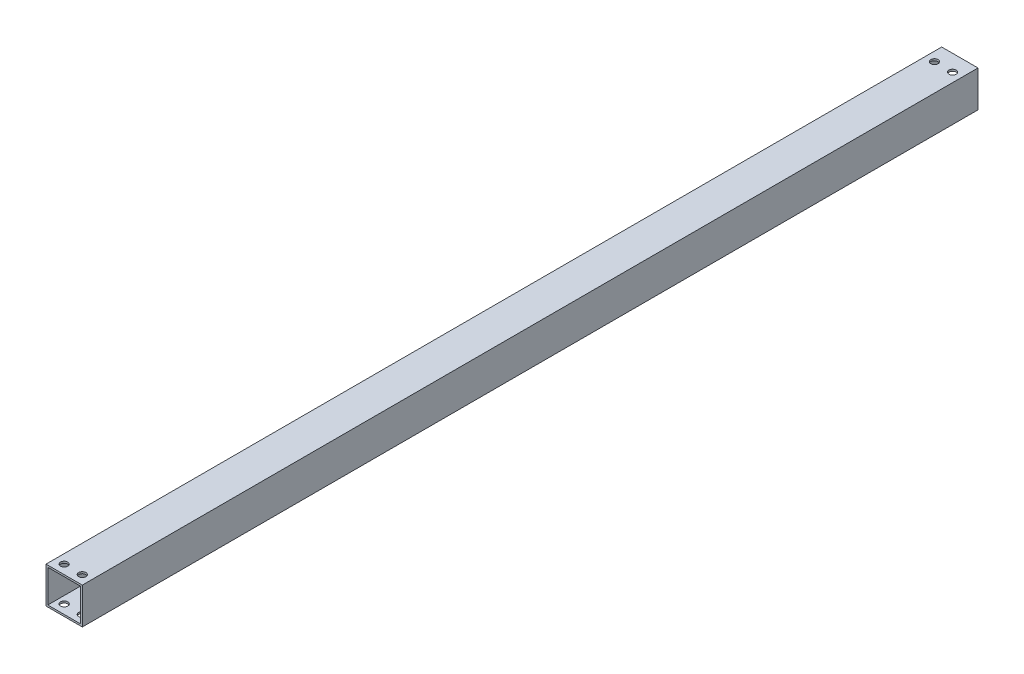
ISO-10303-21;
HEADER;
FILE_DESCRIPTION(('STEP AP214'),'2;1');
FILE_NAME('part.step','',(''),(''),'','','');
FILE_SCHEMA(('AUTOMOTIVE_DESIGN { 1 0 10303 214 1 1 1 1 }'));
ENDSEC;
DATA;
#1=APPLICATION_CONTEXT('core data for automotive mechanical design processes');
#2=APPLICATION_PROTOCOL_DEFINITION('international standard','automotive_design',2000,#1);
#3=PRODUCT_CONTEXT('',#1,'mechanical');
#4=PRODUCT('Part','Part','',(#3));
#5=PRODUCT_RELATED_PRODUCT_CATEGORY('part','',(#4));
#6=PRODUCT_DEFINITION_FORMATION('','',#4);
#7=PRODUCT_DEFINITION_CONTEXT('part definition',#1,'design');
#8=PRODUCT_DEFINITION('design','',#6,#7);
#9=PRODUCT_DEFINITION_SHAPE('','',#8);
#10=(LENGTH_UNIT() NAMED_UNIT(*) SI_UNIT(.MILLI.,.METRE.));
#11=(NAMED_UNIT(*) PLANE_ANGLE_UNIT() SI_UNIT($,.RADIAN.));
#12=(NAMED_UNIT(*) SI_UNIT($,.STERADIAN.) SOLID_ANGLE_UNIT());
#13=UNCERTAINTY_MEASURE_WITH_UNIT(LENGTH_MEASURE(1.E-05),#10,'distance_accuracy_value','');
#14=(GEOMETRIC_REPRESENTATION_CONTEXT(3) GLOBAL_UNCERTAINTY_ASSIGNED_CONTEXT((#13)) GLOBAL_UNIT_ASSIGNED_CONTEXT((#10,
#11,#12)) REPRESENTATION_CONTEXT('',''));
#15=CARTESIAN_POINT('',(0.,0.,0.));
#16=DIRECTION('',(0.,0.,1.));
#17=DIRECTION('',(1.,0.,0.));
#18=AXIS2_PLACEMENT_3D('',#15,#16,#17);
#19=CARTESIAN_POINT('',(0.,0.,493.33));
#20=DIRECTION('',(0.,0.,1.));
#21=DIRECTION('',(1.,0.,0.));
#22=AXIS2_PLACEMENT_3D('',#19,#20,#21);
#23=PLANE('',#22);
#24=DIRECTION('',(0.,1.,0.));
#25=VECTOR('',#24,1.);
#26=CARTESIAN_POINT('',(10.,10.,493.33));
#27=LINE('',#26,#25);
#28=CARTESIAN_POINT('',(10.,-10.,493.33));
#29=VERTEX_POINT('',#28);
#30=CARTESIAN_POINT('',(10.,10.,493.33));
#31=VERTEX_POINT('',#30);
#32=EDGE_CURVE('E161',#29,#31,#27,.T.);
#33=ORIENTED_EDGE('',*,*,#32,.T.);
#34=DIRECTION('',(-1.,0.,0.));
#35=VECTOR('',#34,1.);
#36=CARTESIAN_POINT('',(-10.,10.,493.33));
#37=LINE('',#36,#35);
#38=CARTESIAN_POINT('',(-10.,10.,493.33));
#39=VERTEX_POINT('',#38);
#40=EDGE_CURVE('E165',#31,#39,#37,.T.);
#41=ORIENTED_EDGE('',*,*,#40,.T.);
#42=DIRECTION('',(0.,-1.,0.));
#43=VECTOR('',#42,1.);
#44=CARTESIAN_POINT('',(-10.,10.,493.33));
#45=LINE('',#44,#43);
#46=CARTESIAN_POINT('',(-10.,-10.,493.33));
#47=VERTEX_POINT('',#46);
#48=EDGE_CURVE('E169',#39,#47,#45,.T.);
#49=ORIENTED_EDGE('',*,*,#48,.T.);
#50=DIRECTION('',(1.,0.,0.));
#51=VECTOR('',#50,1.);
#52=CARTESIAN_POINT('',(-10.,-10.,493.33));
#53=LINE('',#52,#51);
#54=EDGE_CURVE('E172',#47,#29,#53,.T.);
#55=ORIENTED_EDGE('',*,*,#54,.T.);
#56=EDGE_LOOP('',(#33,#41,#49,#55));
#57=FACE_BOUND('',#56,.T.);
#58=DIRECTION('',(0.,-1.,0.));
#59=VECTOR('',#58,1.);
#60=CARTESIAN_POINT('',(-9.,9.,493.33));
#61=LINE('',#60,#59);
#62=CARTESIAN_POINT('',(-9.,9.,493.33));
#63=VERTEX_POINT('',#62);
#64=CARTESIAN_POINT('',(-9.,-9.,493.33));
#65=VERTEX_POINT('',#64);
#66=EDGE_CURVE('E119',#63,#65,#61,.T.);
#67=ORIENTED_EDGE('',*,*,#66,.F.);
#68=DIRECTION('',(-1.,0.,0.));
#69=VECTOR('',#68,1.);
#70=CARTESIAN_POINT('',(-9.,9.,493.33));
#71=LINE('',#70,#69);
#72=CARTESIAN_POINT('',(9.,9.,493.33));
#73=VERTEX_POINT('',#72);
#74=EDGE_CURVE('E110',#73,#63,#71,.T.);
#75=ORIENTED_EDGE('',*,*,#74,.F.);
#76=DIRECTION('',(0.,1.,0.));
#77=VECTOR('',#76,1.);
#78=CARTESIAN_POINT('',(9.,9.,493.33));
#79=LINE('',#78,#77);
#80=CARTESIAN_POINT('',(9.,-9.,493.33));
#81=VERTEX_POINT('',#80);
#82=EDGE_CURVE('E138',#81,#73,#79,.T.);
#83=ORIENTED_EDGE('',*,*,#82,.F.);
#84=DIRECTION('',(1.,0.,0.));
#85=VECTOR('',#84,1.);
#86=CARTESIAN_POINT('',(-9.,-9.,493.33));
#87=LINE('',#86,#85);
#88=EDGE_CURVE('E132',#65,#81,#87,.T.);
#89=ORIENTED_EDGE('',*,*,#88,.F.);
#90=EDGE_LOOP('',(#67,#75,#83,#89));
#91=FACE_BOUND('',#90,.T.);
#92=ADVANCED_FACE('F42',(#57,#91),#23,.T.);
#93=CARTESIAN_POINT('',(0.,0.,0.));
#94=DIRECTION('',(0.,0.,1.));
#95=DIRECTION('',(1.,0.,0.));
#96=AXIS2_PLACEMENT_3D('',#93,#94,#95);
#97=PLANE('',#96);
#98=DIRECTION('',(0.,1.,0.));
#99=VECTOR('',#98,1.);
#100=CARTESIAN_POINT('',(10.,10.,0.));
#101=LINE('',#100,#99);
#102=CARTESIAN_POINT('',(10.,-10.,0.));
#103=VERTEX_POINT('',#102);
#104=CARTESIAN_POINT('',(10.,10.,0.));
#105=VERTEX_POINT('',#104);
#106=EDGE_CURVE('E128',#103,#105,#101,.T.);
#107=ORIENTED_EDGE('',*,*,#106,.F.);
#108=DIRECTION('',(1.,0.,0.));
#109=VECTOR('',#108,1.);
#110=CARTESIAN_POINT('',(-10.,-10.,0.));
#111=LINE('',#110,#109);
#112=CARTESIAN_POINT('',(-10.,-10.,0.));
#113=VERTEX_POINT('',#112);
#114=EDGE_CURVE('E166',#113,#103,#111,.T.);
#115=ORIENTED_EDGE('',*,*,#114,.F.);
#116=DIRECTION('',(0.,-1.,0.));
#117=VECTOR('',#116,1.);
#118=CARTESIAN_POINT('',(-10.,10.,0.));
#119=LINE('',#118,#117);
#120=CARTESIAN_POINT('',(-10.,10.,0.));
#121=VERTEX_POINT('',#120);
#122=EDGE_CURVE('E182',#121,#113,#119,.T.);
#123=ORIENTED_EDGE('',*,*,#122,.F.);
#124=DIRECTION('',(-1.,0.,0.));
#125=VECTOR('',#124,1.);
#126=CARTESIAN_POINT('',(-10.,10.,0.));
#127=LINE('',#126,#125);
#128=EDGE_CURVE('E179',#105,#121,#127,.T.);
#129=ORIENTED_EDGE('',*,*,#128,.F.);
#130=EDGE_LOOP('',(#107,#115,#123,#129));
#131=FACE_BOUND('',#130,.T.);
#132=DIRECTION('',(-1.,0.,0.));
#133=VECTOR('',#132,1.);
#134=CARTESIAN_POINT('',(-9.,9.,0.));
#135=LINE('',#134,#133);
#136=CARTESIAN_POINT('',(9.,9.,0.));
#137=VERTEX_POINT('',#136);
#138=CARTESIAN_POINT('',(-9.,9.,0.));
#139=VERTEX_POINT('',#138);
#140=EDGE_CURVE('E68',#137,#139,#135,.T.);
#141=ORIENTED_EDGE('',*,*,#140,.T.);
#142=DIRECTION('',(0.,-1.,0.));
#143=VECTOR('',#142,1.);
#144=CARTESIAN_POINT('',(-9.,9.,0.));
#145=LINE('',#144,#143);
#146=CARTESIAN_POINT('',(-9.,-9.,0.));
#147=VERTEX_POINT('',#146);
#148=EDGE_CURVE('E126',#139,#147,#145,.T.);
#149=ORIENTED_EDGE('',*,*,#148,.T.);
#150=DIRECTION('',(1.,0.,0.));
#151=VECTOR('',#150,1.);
#152=CARTESIAN_POINT('',(-9.,-9.,0.));
#153=LINE('',#152,#151);
#154=CARTESIAN_POINT('',(9.,-9.,0.));
#155=VERTEX_POINT('',#154);
#156=EDGE_CURVE('E148',#147,#155,#153,.T.);
#157=ORIENTED_EDGE('',*,*,#156,.T.);
#158=DIRECTION('',(0.,1.,0.));
#159=VECTOR('',#158,1.);
#160=CARTESIAN_POINT('',(9.,9.,0.));
#161=LINE('',#160,#159);
#162=EDGE_CURVE('E120',#155,#137,#161,.T.);
#163=ORIENTED_EDGE('',*,*,#162,.T.);
#164=EDGE_LOOP('',(#141,#149,#157,#163));
#165=FACE_BOUND('',#164,.T.);
#166=ADVANCED_FACE('F268',(#131,#165),#97,.F.);
#167=CARTESIAN_POINT('',(10.,10.,493.33));
#168=DIRECTION('',(-1.,0.,0.));
#169=DIRECTION('',(0.,-1.,0.));
#170=AXIS2_PLACEMENT_3D('',#167,#168,#169);
#171=PLANE('',#170);
#172=ORIENTED_EDGE('',*,*,#106,.T.);
#173=DIRECTION('',(0.,0.,-1.));
#174=VECTOR('',#173,1.);
#175=CARTESIAN_POINT('',(10.,10.,493.33));
#176=LINE('',#175,#174);
#177=EDGE_CURVE('E11',#31,#105,#176,.T.);
#178=ORIENTED_EDGE('',*,*,#177,.F.);
#179=ORIENTED_EDGE('',*,*,#32,.F.);
#180=DIRECTION('',(0.,0.,-1.));
#181=VECTOR('',#180,1.);
#182=CARTESIAN_POINT('',(10.,-10.,493.33));
#183=LINE('',#182,#181);
#184=EDGE_CURVE('E175',#29,#103,#183,.T.);
#185=ORIENTED_EDGE('',*,*,#184,.T.);
#186=EDGE_LOOP('',(#172,#178,#179,#185));
#187=FACE_BOUND('',#186,.T.);
#188=ADVANCED_FACE('F44',(#187),#171,.F.);
#189=CARTESIAN_POINT('',(-10.,10.,493.33));
#190=DIRECTION('',(0.,-1.,0.));
#191=DIRECTION('',(0.,0.,-1.));
#192=AXIS2_PLACEMENT_3D('',#189,#190,#191);
#193=PLANE('',#192);
#194=CARTESIAN_POINT('',(5.00000000000336,10.,488.329999999999));
#195=DIRECTION('',(0.,-1.,0.));
#196=DIRECTION('',(0.,0.,-1.));
#197=AXIS2_PLACEMENT_3D('',#194,#195,#196);
#198=CIRCLE('',#197,2.00000000000269);
#199=CARTESIAN_POINT('',(5.00000000000336,10.,486.329999999996));
#200=VERTEX_POINT('',#199);
#201=EDGE_CURVE('E210',#200,#200,#198,.F.);
#202=ORIENTED_EDGE('',*,*,#201,.F.);
#203=EDGE_LOOP('',(#202));
#204=FACE_BOUND('',#203,.T.);
#205=CARTESIAN_POINT('',(-5.,10.,488.33));
#206=DIRECTION('',(0.,-1.,0.));
#207=DIRECTION('',(0.,0.,-1.));
#208=AXIS2_PLACEMENT_3D('',#205,#206,#207);
#209=CIRCLE('',#208,2.);
#210=CARTESIAN_POINT('',(-5.,10.,486.33));
#211=VERTEX_POINT('',#210);
#212=EDGE_CURVE('E205',#211,#211,#209,.F.);
#213=ORIENTED_EDGE('',*,*,#212,.F.);
#214=EDGE_LOOP('',(#213));
#215=FACE_BOUND('',#214,.T.);
#216=CARTESIAN_POINT('',(-5.00000000000325,10.,8.99999999999856));
#217=DIRECTION('',(0.,-1.,0.));
#218=DIRECTION('',(0.,0.,-1.));
#219=AXIS2_PLACEMENT_3D('',#216,#217,#218);
#220=CIRCLE('',#219,2.);
#221=CARTESIAN_POINT('',(-5.00000000000325,10.,6.99999999999856));
#222=VERTEX_POINT('',#221);
#223=EDGE_CURVE('E145',#222,#222,#220,.T.);
#224=ORIENTED_EDGE('',*,*,#223,.T.);
#225=EDGE_LOOP('',(#224));
#226=FACE_BOUND('',#225,.T.);
#227=CARTESIAN_POINT('',(5.00000000000331,10.,8.99999999999856));
#228=DIRECTION('',(0.,-1.,0.));
#229=DIRECTION('',(0.,0.,-1.));
#230=AXIS2_PLACEMENT_3D('',#227,#228,#229);
#231=CIRCLE('',#230,2.);
#232=CARTESIAN_POINT('',(5.00000000000331,10.,6.99999999999856));
#233=VERTEX_POINT('',#232);
#234=EDGE_CURVE('E237',#233,#233,#231,.T.);
#235=ORIENTED_EDGE('',*,*,#234,.T.);
#236=EDGE_LOOP('',(#235));
#237=FACE_BOUND('',#236,.T.);
#238=ORIENTED_EDGE('',*,*,#128,.T.);
#239=DIRECTION('',(0.,0.,-1.));
#240=VECTOR('',#239,1.);
#241=CARTESIAN_POINT('',(-10.,10.,493.33));
#242=LINE('',#241,#240);
#243=EDGE_CURVE('E52',#39,#121,#242,.T.);
#244=ORIENTED_EDGE('',*,*,#243,.F.);
#245=ORIENTED_EDGE('',*,*,#40,.F.);
#246=ORIENTED_EDGE('',*,*,#177,.T.);
#247=EDGE_LOOP('',(#238,#244,#245,#246));
#248=FACE_BOUND('',#247,.T.);
#249=ADVANCED_FACE('F247',(#204,#215,#226,#237,#248),#193,.F.);
#250=CARTESIAN_POINT('',(-10.,10.,493.33));
#251=DIRECTION('',(1.,0.,0.));
#252=DIRECTION('',(0.,1.,0.));
#253=AXIS2_PLACEMENT_3D('',#250,#251,#252);
#254=PLANE('',#253);
#255=ORIENTED_EDGE('',*,*,#122,.T.);
#256=DIRECTION('',(0.,0.,-1.));
#257=VECTOR('',#256,1.);
#258=CARTESIAN_POINT('',(-10.,-10.,493.33));
#259=LINE('',#258,#257);
#260=EDGE_CURVE('E189',#47,#113,#259,.T.);
#261=ORIENTED_EDGE('',*,*,#260,.F.);
#262=ORIENTED_EDGE('',*,*,#48,.F.);
#263=ORIENTED_EDGE('',*,*,#243,.T.);
#264=EDGE_LOOP('',(#255,#261,#262,#263));
#265=FACE_BOUND('',#264,.T.);
#266=ADVANCED_FACE('F281',(#265),#254,.F.);
#267=CARTESIAN_POINT('',(-10.,-10.,493.33));
#268=DIRECTION('',(0.,1.,0.));
#269=DIRECTION('',(0.,0.,1.));
#270=AXIS2_PLACEMENT_3D('',#267,#268,#269);
#271=PLANE('',#270);
#272=CARTESIAN_POINT('',(5.00000000000331,-10.,8.99999999999856));
#273=DIRECTION('',(0.,1.,0.));
#274=DIRECTION('',(0.,0.,1.));
#275=AXIS2_PLACEMENT_3D('',#272,#273,#274);
#276=CIRCLE('',#275,2.00000000000268);
#277=CARTESIAN_POINT('',(5.00000000000331,-10.,11.0000000000013));
#278=VERTEX_POINT('',#277);
#279=EDGE_CURVE('E229',#278,#278,#276,.F.);
#280=ORIENTED_EDGE('',*,*,#279,.F.);
#281=EDGE_LOOP('',(#280));
#282=FACE_BOUND('',#281,.T.);
#283=CARTESIAN_POINT('',(-5.00000000000325,-10.,8.99999999999856));
#284=DIRECTION('',(0.,1.,0.));
#285=DIRECTION('',(0.,0.,1.));
#286=AXIS2_PLACEMENT_3D('',#283,#284,#285);
#287=CIRCLE('',#286,2.00000000000268);
#288=CARTESIAN_POINT('',(-5.00000000000325,-10.,11.0000000000013));
#289=VERTEX_POINT('',#288);
#290=EDGE_CURVE('E209',#289,#289,#287,.F.);
#291=ORIENTED_EDGE('',*,*,#290,.F.);
#292=EDGE_LOOP('',(#291));
#293=FACE_BOUND('',#292,.T.);
#294=CARTESIAN_POINT('',(5.00000000000336,-10.,488.329999999999));
#295=DIRECTION('',(0.,1.,0.));
#296=DIRECTION('',(0.,0.,1.));
#297=AXIS2_PLACEMENT_3D('',#294,#295,#296);
#298=CIRCLE('',#297,2.00000000000269);
#299=CARTESIAN_POINT('',(5.00000000000336,-10.,490.330000000001));
#300=VERTEX_POINT('',#299);
#301=EDGE_CURVE('E219',#300,#300,#298,.F.);
#302=ORIENTED_EDGE('',*,*,#301,.F.);
#303=EDGE_LOOP('',(#302));
#304=FACE_BOUND('',#303,.T.);
#305=CARTESIAN_POINT('',(-5.,-10.,488.33));
#306=DIRECTION('',(0.,1.,0.));
#307=DIRECTION('',(0.,0.,1.));
#308=AXIS2_PLACEMENT_3D('',#305,#306,#307);
#309=CIRCLE('',#308,2.);
#310=CARTESIAN_POINT('',(-5.,-10.,490.33));
#311=VERTEX_POINT('',#310);
#312=EDGE_CURVE('E295',#311,#311,#309,.F.);
#313=ORIENTED_EDGE('',*,*,#312,.F.);
#314=EDGE_LOOP('',(#313));
#315=FACE_BOUND('',#314,.T.);
#316=ORIENTED_EDGE('',*,*,#114,.T.);
#317=ORIENTED_EDGE('',*,*,#184,.F.);
#318=ORIENTED_EDGE('',*,*,#54,.F.);
#319=ORIENTED_EDGE('',*,*,#260,.T.);
#320=EDGE_LOOP('',(#316,#317,#318,#319));
#321=FACE_BOUND('',#320,.T.);
#322=ADVANCED_FACE('F278',(#282,#293,#304,#315,#321),#271,.F.);
#323=CARTESIAN_POINT('',(-9.,9.,493.33));
#324=DIRECTION('',(0.,-1.,0.));
#325=DIRECTION('',(0.,0.,-1.));
#326=AXIS2_PLACEMENT_3D('',#323,#324,#325);
#327=PLANE('',#326);
#328=CARTESIAN_POINT('',(5.00000000000336,9.00000000000001,488.329999999999));
#329=DIRECTION('',(0.,-1.,0.));
#330=DIRECTION('',(0.,0.,-1.));
#331=AXIS2_PLACEMENT_3D('',#328,#329,#330);
#332=CIRCLE('',#331,2.00000000000269);
#333=CARTESIAN_POINT('',(5.00000000000336,9.00000000000001,486.329999999996));
#334=VERTEX_POINT('',#333);
#335=EDGE_CURVE('E204',#334,#334,#332,.F.);
#336=ORIENTED_EDGE('',*,*,#335,.T.);
#337=EDGE_LOOP('',(#336));
#338=FACE_BOUND('',#337,.T.);
#339=CARTESIAN_POINT('',(-5.,9.00000000000001,488.33));
#340=DIRECTION('',(0.,-1.,0.));
#341=DIRECTION('',(0.,0.,-1.));
#342=AXIS2_PLACEMENT_3D('',#339,#340,#341);
#343=CIRCLE('',#342,2.);
#344=CARTESIAN_POINT('',(-5.,9.00000000000001,486.33));
#345=VERTEX_POINT('',#344);
#346=EDGE_CURVE('E200',#345,#345,#343,.F.);
#347=ORIENTED_EDGE('',*,*,#346,.T.);
#348=EDGE_LOOP('',(#347));
#349=FACE_BOUND('',#348,.T.);
#350=CARTESIAN_POINT('',(-5.00000000000325,8.99999999991815,8.99999999999856));
#351=DIRECTION('',(0.,-1.,0.));
#352=DIRECTION('',(0.,0.,-1.));
#353=AXIS2_PLACEMENT_3D('',#350,#351,#352);
#354=CIRCLE('',#353,2.);
#355=CARTESIAN_POINT('',(-5.00000000000325,8.99999999991815,6.99999999999856));
#356=VERTEX_POINT('',#355);
#357=EDGE_CURVE('E234',#356,#356,#354,.T.);
#358=ORIENTED_EDGE('',*,*,#357,.F.);
#359=EDGE_LOOP('',(#358));
#360=FACE_BOUND('',#359,.T.);
#361=CARTESIAN_POINT('',(5.00000000000331,8.99999999991815,8.99999999999856));
#362=DIRECTION('',(0.,-1.,0.));
#363=DIRECTION('',(0.,0.,-1.));
#364=AXIS2_PLACEMENT_3D('',#361,#362,#363);
#365=CIRCLE('',#364,2.);
#366=CARTESIAN_POINT('',(5.00000000000331,8.99999999991815,6.99999999999856));
#367=VERTEX_POINT('',#366);
#368=EDGE_CURVE('E233',#367,#367,#365,.T.);
#369=ORIENTED_EDGE('',*,*,#368,.F.);
#370=EDGE_LOOP('',(#369));
#371=FACE_BOUND('',#370,.T.);
#372=ORIENTED_EDGE('',*,*,#140,.F.);
#373=DIRECTION('',(0.,0.,-1.));
#374=VECTOR('',#373,1.);
#375=CARTESIAN_POINT('',(9.,9.,493.33));
#376=LINE('',#375,#374);
#377=EDGE_CURVE('E114',#73,#137,#376,.T.);
#378=ORIENTED_EDGE('',*,*,#377,.F.);
#379=ORIENTED_EDGE('',*,*,#74,.T.);
#380=DIRECTION('',(0.,0.,-1.));
#381=VECTOR('',#380,1.);
#382=CARTESIAN_POINT('',(-9.,9.,493.33));
#383=LINE('',#382,#381);
#384=EDGE_CURVE('E113',#63,#139,#383,.T.);
#385=ORIENTED_EDGE('',*,*,#384,.T.);
#386=EDGE_LOOP('',(#372,#378,#379,#385));
#387=FACE_BOUND('',#386,.T.);
#388=ADVANCED_FACE('F112',(#338,#349,#360,#371,#387),#327,.T.);
#389=CARTESIAN_POINT('',(-9.,9.,493.33));
#390=DIRECTION('',(1.,0.,0.));
#391=DIRECTION('',(0.,1.,0.));
#392=AXIS2_PLACEMENT_3D('',#389,#390,#391);
#393=PLANE('',#392);
#394=ORIENTED_EDGE('',*,*,#148,.F.);
#395=ORIENTED_EDGE('',*,*,#384,.F.);
#396=ORIENTED_EDGE('',*,*,#66,.T.);
#397=DIRECTION('',(0.,0.,-1.));
#398=VECTOR('',#397,1.);
#399=CARTESIAN_POINT('',(-9.,-9.,493.33));
#400=LINE('',#399,#398);
#401=EDGE_CURVE('E129',#65,#147,#400,.T.);
#402=ORIENTED_EDGE('',*,*,#401,.T.);
#403=EDGE_LOOP('',(#394,#395,#396,#402));
#404=FACE_BOUND('',#403,.T.);
#405=ADVANCED_FACE('F123',(#404),#393,.T.);
#406=CARTESIAN_POINT('',(-9.,-9.,493.33));
#407=DIRECTION('',(0.,1.,0.));
#408=DIRECTION('',(0.,0.,1.));
#409=AXIS2_PLACEMENT_3D('',#406,#407,#408);
#410=PLANE('',#409);
#411=CARTESIAN_POINT('',(5.00000000000331,-9.00000000000001,8.99999999999856));
#412=DIRECTION('',(0.,1.,0.));
#413=DIRECTION('',(0.,0.,1.));
#414=AXIS2_PLACEMENT_3D('',#411,#412,#413);
#415=CIRCLE('',#414,2.00000000000268);
#416=CARTESIAN_POINT('',(5.00000000000331,-9.00000000000001,11.0000000000013));
#417=VERTEX_POINT('',#416);
#418=EDGE_CURVE('E46',#417,#417,#415,.F.);
#419=ORIENTED_EDGE('',*,*,#418,.T.);
#420=EDGE_LOOP('',(#419));
#421=FACE_BOUND('',#420,.T.);
#422=CARTESIAN_POINT('',(-5.00000000000325,-9.00000000000001,8.99999999999856));
#423=DIRECTION('',(0.,1.,0.));
#424=DIRECTION('',(0.,0.,1.));
#425=AXIS2_PLACEMENT_3D('',#422,#423,#424);
#426=CIRCLE('',#425,2.00000000000268);
#427=CARTESIAN_POINT('',(-5.00000000000325,-9.00000000000001,11.0000000000013));
#428=VERTEX_POINT('',#427);
#429=EDGE_CURVE('E206',#428,#428,#426,.F.);
#430=ORIENTED_EDGE('',*,*,#429,.T.);
#431=EDGE_LOOP('',(#430));
#432=FACE_BOUND('',#431,.T.);
#433=CARTESIAN_POINT('',(5.00000000000336,-9.00000000000001,488.329999999999));
#434=DIRECTION('',(0.,1.,0.));
#435=DIRECTION('',(0.,0.,1.));
#436=AXIS2_PLACEMENT_3D('',#433,#434,#435);
#437=CIRCLE('',#436,2.00000000000269);
#438=CARTESIAN_POINT('',(5.00000000000336,-9.00000000000001,490.330000000001));
#439=VERTEX_POINT('',#438);
#440=EDGE_CURVE('E201',#439,#439,#437,.F.);
#441=ORIENTED_EDGE('',*,*,#440,.T.);
#442=EDGE_LOOP('',(#441));
#443=FACE_BOUND('',#442,.T.);
#444=CARTESIAN_POINT('',(-5.,-9.00000000000001,488.33));
#445=DIRECTION('',(0.,1.,0.));
#446=DIRECTION('',(0.,0.,1.));
#447=AXIS2_PLACEMENT_3D('',#444,#445,#446);
#448=CIRCLE('',#447,2.);
#449=CARTESIAN_POINT('',(-5.,-9.00000000000001,490.33));
#450=VERTEX_POINT('',#449);
#451=EDGE_CURVE('E196',#450,#450,#448,.F.);
#452=ORIENTED_EDGE('',*,*,#451,.T.);
#453=EDGE_LOOP('',(#452));
#454=FACE_BOUND('',#453,.T.);
#455=ORIENTED_EDGE('',*,*,#156,.F.);
#456=ORIENTED_EDGE('',*,*,#401,.F.);
#457=ORIENTED_EDGE('',*,*,#88,.T.);
#458=DIRECTION('',(0.,0.,-1.));
#459=VECTOR('',#458,1.);
#460=CARTESIAN_POINT('',(9.,-9.,493.33));
#461=LINE('',#460,#459);
#462=EDGE_CURVE('E60',#81,#155,#461,.T.);
#463=ORIENTED_EDGE('',*,*,#462,.T.);
#464=EDGE_LOOP('',(#455,#456,#457,#463));
#465=FACE_BOUND('',#464,.T.);
#466=ADVANCED_FACE('F340',(#421,#432,#443,#454,#465),#410,.T.);
#467=CARTESIAN_POINT('',(9.,9.,493.33));
#468=DIRECTION('',(-1.,0.,0.));
#469=DIRECTION('',(0.,-1.,0.));
#470=AXIS2_PLACEMENT_3D('',#467,#468,#469);
#471=PLANE('',#470);
#472=ORIENTED_EDGE('',*,*,#162,.F.);
#473=ORIENTED_EDGE('',*,*,#462,.F.);
#474=ORIENTED_EDGE('',*,*,#82,.T.);
#475=ORIENTED_EDGE('',*,*,#377,.T.);
#476=EDGE_LOOP('',(#472,#473,#474,#475));
#477=FACE_BOUND('',#476,.T.);
#478=ADVANCED_FACE('F263',(#477),#471,.T.);
#479=CARTESIAN_POINT('',(5.00000000000331,28.9999999999182,8.99999999999856));
#480=DIRECTION('',(0.,-1.,0.));
#481=DIRECTION('',(0.,0.,-1.));
#482=AXIS2_PLACEMENT_3D('',#479,#480,#481);
#483=CYLINDRICAL_SURFACE('',#482,2.);
#484=ORIENTED_EDGE('',*,*,#368,.T.);
#485=EDGE_LOOP('',(#484));
#486=FACE_BOUND('',#485,.T.);
#487=ORIENTED_EDGE('',*,*,#234,.F.);
#488=EDGE_LOOP('',(#487));
#489=FACE_BOUND('',#488,.T.);
#490=ADVANCED_FACE('F253',(#486,#489),#483,.F.);
#491=CARTESIAN_POINT('',(-5.00000000000325,28.9999999999182,8.99999999999856));
#492=DIRECTION('',(0.,-1.,0.));
#493=DIRECTION('',(0.,0.,-1.));
#494=AXIS2_PLACEMENT_3D('',#491,#492,#493);
#495=CYLINDRICAL_SURFACE('',#494,2.);
#496=ORIENTED_EDGE('',*,*,#357,.T.);
#497=EDGE_LOOP('',(#496));
#498=FACE_BOUND('',#497,.T.);
#499=ORIENTED_EDGE('',*,*,#223,.F.);
#500=EDGE_LOOP('',(#499));
#501=FACE_BOUND('',#500,.T.);
#502=ADVANCED_FACE('F250',(#498,#501),#495,.F.);
#503=CARTESIAN_POINT('',(-5.,137.,488.33));
#504=DIRECTION('',(0.,-1.,0.));
#505=DIRECTION('',(0.,0.,-1.));
#506=AXIS2_PLACEMENT_3D('',#503,#504,#505);
#507=CYLINDRICAL_SURFACE('',#506,2.);
#508=ORIENTED_EDGE('',*,*,#451,.F.);
#509=EDGE_LOOP('',(#508));
#510=FACE_BOUND('',#509,.T.);
#511=ORIENTED_EDGE('',*,*,#312,.T.);
#512=EDGE_LOOP('',(#511));
#513=FACE_BOUND('',#512,.T.);
#514=ADVANCED_FACE('F252',(#510,#513),#507,.F.);
#515=CARTESIAN_POINT('',(5.00000000000336,137.,488.329999999999));
#516=DIRECTION('',(0.,-1.,0.));
#517=DIRECTION('',(0.,0.,-1.));
#518=AXIS2_PLACEMENT_3D('',#515,#516,#517);
#519=CYLINDRICAL_SURFACE('',#518,2.00000000000269);
#520=ORIENTED_EDGE('',*,*,#440,.F.);
#521=EDGE_LOOP('',(#520));
#522=FACE_BOUND('',#521,.T.);
#523=ORIENTED_EDGE('',*,*,#301,.T.);
#524=EDGE_LOOP('',(#523));
#525=FACE_BOUND('',#524,.T.);
#526=ADVANCED_FACE('F259',(#522,#525),#519,.F.);
#527=CARTESIAN_POINT('',(-5.00000000000325,137.,8.99999999999856));
#528=DIRECTION('',(0.,-1.,0.));
#529=DIRECTION('',(0.,0.,-1.));
#530=AXIS2_PLACEMENT_3D('',#527,#528,#529);
#531=CYLINDRICAL_SURFACE('',#530,2.00000000000268);
#532=ORIENTED_EDGE('',*,*,#429,.F.);
#533=EDGE_LOOP('',(#532));
#534=FACE_BOUND('',#533,.T.);
#535=ORIENTED_EDGE('',*,*,#290,.T.);
#536=EDGE_LOOP('',(#535));
#537=FACE_BOUND('',#536,.T.);
#538=ADVANCED_FACE('F314',(#534,#537),#531,.F.);
#539=CARTESIAN_POINT('',(5.00000000000331,137.,8.99999999999856));
#540=DIRECTION('',(0.,-1.,0.));
#541=DIRECTION('',(0.,0.,-1.));
#542=AXIS2_PLACEMENT_3D('',#539,#540,#541);
#543=CYLINDRICAL_SURFACE('',#542,2.00000000000268);
#544=ORIENTED_EDGE('',*,*,#418,.F.);
#545=EDGE_LOOP('',(#544));
#546=FACE_BOUND('',#545,.T.);
#547=ORIENTED_EDGE('',*,*,#279,.T.);
#548=EDGE_LOOP('',(#547));
#549=FACE_BOUND('',#548,.T.);
#550=ADVANCED_FACE('F311',(#546,#549),#543,.F.);
#551=ORIENTED_EDGE('',*,*,#346,.F.);
#552=EDGE_LOOP('',(#551));
#553=FACE_BOUND('',#552,.T.);
#554=ORIENTED_EDGE('',*,*,#212,.T.);
#555=EDGE_LOOP('',(#554));
#556=FACE_BOUND('',#555,.T.);
#557=ADVANCED_FACE('F262',(#553,#556),#507,.F.);
#558=ORIENTED_EDGE('',*,*,#335,.F.);
#559=EDGE_LOOP('',(#558));
#560=FACE_BOUND('',#559,.T.);
#561=ORIENTED_EDGE('',*,*,#201,.T.);
#562=EDGE_LOOP('',(#561));
#563=FACE_BOUND('',#562,.T.);
#564=ADVANCED_FACE('F306',(#560,#563),#519,.F.);
#565=CLOSED_SHELL('',(#92,#166,#188,#249,#266,#322,#388,#405,#466,#478,#490,#502,#514,#526,#538,
#550,#557,#564));
#566=MANIFOLD_SOLID_BREP('B2',#565);
#567=ADVANCED_BREP_SHAPE_REPRESENTATION('',(#18,#566),#14);
#568=SHAPE_DEFINITION_REPRESENTATION(#9,#567);
ENDSEC;
END-ISO-10303-21;
